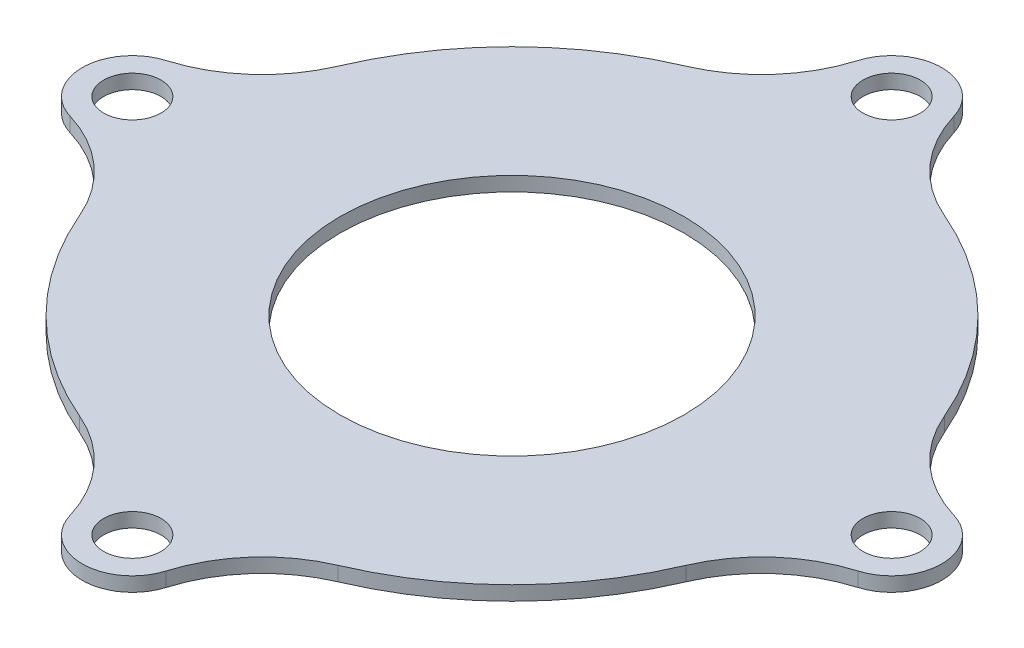
ISO-10303-21;
HEADER;
FILE_DESCRIPTION(('STEP AP214'),'2;1');
FILE_NAME('part.step','',(''),(''),'','','');
FILE_SCHEMA(('AUTOMOTIVE_DESIGN { 1 0 10303 214 1 1 1 1 }'));
ENDSEC;
DATA;
#1=APPLICATION_CONTEXT('core data for automotive mechanical design processes');
#2=APPLICATION_PROTOCOL_DEFINITION('international standard','automotive_design',2000,#1);
#3=PRODUCT_CONTEXT('',#1,'mechanical');
#4=PRODUCT('Part','Part','',(#3));
#5=PRODUCT_RELATED_PRODUCT_CATEGORY('part','',(#4));
#6=PRODUCT_DEFINITION_FORMATION('','',#4);
#7=PRODUCT_DEFINITION_CONTEXT('part definition',#1,'design');
#8=PRODUCT_DEFINITION('design','',#6,#7);
#9=PRODUCT_DEFINITION_SHAPE('','',#8);
#10=(LENGTH_UNIT() NAMED_UNIT(*) SI_UNIT(.MILLI.,.METRE.));
#11=(NAMED_UNIT(*) PLANE_ANGLE_UNIT() SI_UNIT($,.RADIAN.));
#12=(NAMED_UNIT(*) SI_UNIT($,.STERADIAN.) SOLID_ANGLE_UNIT());
#13=UNCERTAINTY_MEASURE_WITH_UNIT(LENGTH_MEASURE(1.E-05),#10,'distance_accuracy_value','');
#14=(GEOMETRIC_REPRESENTATION_CONTEXT(3) GLOBAL_UNCERTAINTY_ASSIGNED_CONTEXT((#13)) GLOBAL_UNIT_ASSIGNED_CONTEXT((#10,
#11,#12)) REPRESENTATION_CONTEXT('',''));
#15=CARTESIAN_POINT('',(0.,0.,0.));
#16=DIRECTION('',(0.,0.,1.));
#17=DIRECTION('',(1.,0.,0.));
#18=AXIS2_PLACEMENT_3D('',#15,#16,#17);
#19=CARTESIAN_POINT('',(0.,3.,0.));
#20=DIRECTION('',(0.,-1.,0.));
#21=DIRECTION('',(0.,0.,-1.));
#22=AXIS2_PLACEMENT_3D('',#19,#20,#21);
#23=CYLINDRICAL_SURFACE('',#22,23.);
#24=CARTESIAN_POINT('',(0.,1.,0.));
#25=DIRECTION('',(0.,1.,0.));
#26=DIRECTION('',(0.,0.,1.));
#27=AXIS2_PLACEMENT_3D('',#24,#25,#26);
#28=CIRCLE('',#27,23.);
#29=CARTESIAN_POINT('',(-21.1589479702687,1.,-9.01659141757354));
#30=VERTEX_POINT('',#29);
#31=CARTESIAN_POINT('',(-9.01659141757377,0.999999999999973,-21.1589479702686));
#32=VERTEX_POINT('',#31);
#33=EDGE_CURVE('E154',#30,#32,#28,.F.);
#34=ORIENTED_EDGE('',*,*,#33,.T.);
#35=DIRECTION('',(0.,-1.,0.));
#36=VECTOR('',#35,1.);
#37=CARTESIAN_POINT('',(-9.01659141757377,3.,-21.1589479702686));
#38=LINE('',#37,#36);
#39=CARTESIAN_POINT('',(-9.01659141757377,0.,-21.1589479702686));
#40=VERTEX_POINT('',#39);
#41=EDGE_CURVE('E167',#32,#40,#38,.T.);
#42=ORIENTED_EDGE('',*,*,#41,.T.);
#43=CARTESIAN_POINT('',(0.,0.,0.));
#44=DIRECTION('',(0.,1.,0.));
#45=DIRECTION('',(0.,0.,1.));
#46=AXIS2_PLACEMENT_3D('',#43,#44,#45);
#47=CIRCLE('',#46,23.);
#48=CARTESIAN_POINT('',(-21.1589479702687,0.,-9.01659141757355));
#49=VERTEX_POINT('',#48);
#50=EDGE_CURVE('E267',#40,#49,#47,.T.);
#51=ORIENTED_EDGE('',*,*,#50,.T.);
#52=DIRECTION('',(0.,-1.,0.));
#53=VECTOR('',#52,1.);
#54=CARTESIAN_POINT('',(-21.1589479702687,3.,-9.01659141757355));
#55=LINE('',#54,#53);
#56=EDGE_CURVE('E170',#49,#30,#55,.F.);
#57=ORIENTED_EDGE('',*,*,#56,.T.);
#58=EDGE_LOOP('',(#34,#42,#51,#57));
#59=FACE_BOUND('',#58,.T.);
#60=ADVANCED_FACE('F39',(#59),#23,.T.);
#61=CARTESIAN_POINT('',(0.,1.,0.));
#62=DIRECTION('',(0.,1.,0.));
#63=DIRECTION('',(0.,0.,1.));
#64=AXIS2_PLACEMENT_3D('',#61,#62,#63);
#65=CIRCLE('',#64,23.);
#66=CARTESIAN_POINT('',(9.01659141757332,1.,-21.1589479702688));
#67=VERTEX_POINT('',#66);
#68=CARTESIAN_POINT('',(21.1589479702687,1.,-9.01659141757369));
#69=VERTEX_POINT('',#68);
#70=EDGE_CURVE('E249',#67,#69,#65,.F.);
#71=ORIENTED_EDGE('',*,*,#70,.T.);
#72=DIRECTION('',(0.,-1.,0.));
#73=VECTOR('',#72,1.);
#74=CARTESIAN_POINT('',(21.1589479702687,3.,-9.0165914175737));
#75=LINE('',#74,#73);
#76=CARTESIAN_POINT('',(21.1589479702687,0.,-9.01659141757369));
#77=VERTEX_POINT('',#76);
#78=EDGE_CURVE('E288',#69,#77,#75,.T.);
#79=ORIENTED_EDGE('',*,*,#78,.T.);
#80=CARTESIAN_POINT('',(9.01659141757333,0.,-21.1589479702688));
#81=VERTEX_POINT('',#80);
#82=EDGE_CURVE('E301',#77,#81,#47,.T.);
#83=ORIENTED_EDGE('',*,*,#82,.T.);
#84=DIRECTION('',(0.,-1.,0.));
#85=VECTOR('',#84,1.);
#86=CARTESIAN_POINT('',(9.01659141757333,3.,-21.1589479702688));
#87=LINE('',#86,#85);
#88=EDGE_CURVE('E285',#81,#67,#87,.F.);
#89=ORIENTED_EDGE('',*,*,#88,.T.);
#90=EDGE_LOOP('',(#71,#79,#83,#89));
#91=FACE_BOUND('',#90,.T.);
#92=ADVANCED_FACE('F322',(#91),#23,.T.);
#93=CARTESIAN_POINT('',(0.,1.,0.));
#94=DIRECTION('',(0.,1.,0.));
#95=DIRECTION('',(0.,0.,1.));
#96=AXIS2_PLACEMENT_3D('',#93,#94,#95);
#97=CIRCLE('',#96,23.);
#98=CARTESIAN_POINT('',(21.1589479702688,1.,9.0165914175734));
#99=VERTEX_POINT('',#98);
#100=CARTESIAN_POINT('',(9.01659141757363,1.,21.1589479702687));
#101=VERTEX_POINT('',#100);
#102=EDGE_CURVE('E237',#99,#101,#97,.F.);
#103=ORIENTED_EDGE('',*,*,#102,.T.);
#104=DIRECTION('',(0.,-1.,0.));
#105=VECTOR('',#104,1.);
#106=CARTESIAN_POINT('',(9.01659141757362,3.,21.1589479702687));
#107=LINE('',#106,#105);
#108=CARTESIAN_POINT('',(9.01659141757362,0.,21.1589479702687));
#109=VERTEX_POINT('',#108);
#110=EDGE_CURVE('E273',#101,#109,#107,.T.);
#111=ORIENTED_EDGE('',*,*,#110,.T.);
#112=CARTESIAN_POINT('',(21.1589479702688,0.,9.0165914175734));
#113=VERTEX_POINT('',#112);
#114=EDGE_CURVE('E270',#109,#113,#47,.T.);
#115=ORIENTED_EDGE('',*,*,#114,.T.);
#116=DIRECTION('',(0.,-1.,0.));
#117=VECTOR('',#116,1.);
#118=CARTESIAN_POINT('',(21.1589479702688,3.,9.0165914175734));
#119=LINE('',#118,#117);
#120=EDGE_CURVE('E269',#113,#99,#119,.F.);
#121=ORIENTED_EDGE('',*,*,#120,.T.);
#122=EDGE_LOOP('',(#103,#111,#115,#121));
#123=FACE_BOUND('',#122,.T.);
#124=ADVANCED_FACE('F307',(#123),#23,.T.);
#125=CARTESIAN_POINT('',(0.,1.,0.));
#126=DIRECTION('',(0.,1.,0.));
#127=DIRECTION('',(0.,0.,1.));
#128=AXIS2_PLACEMENT_3D('',#125,#126,#127);
#129=CIRCLE('',#128,23.);
#130=CARTESIAN_POINT('',(-9.01659141757347,1.,21.1589479702688));
#131=VERTEX_POINT('',#130);
#132=CARTESIAN_POINT('',(-21.1589479702687,1.,9.01659141757353));
#133=VERTEX_POINT('',#132);
#134=EDGE_CURVE('E54',#131,#133,#129,.F.);
#135=ORIENTED_EDGE('',*,*,#134,.T.);
#136=DIRECTION('',(0.,-1.,0.));
#137=VECTOR('',#136,1.);
#138=CARTESIAN_POINT('',(-21.1589479702687,3.,9.01659141757355));
#139=LINE('',#138,#137);
#140=CARTESIAN_POINT('',(-21.1589479702687,0.,9.01659141757355));
#141=VERTEX_POINT('',#140);
#142=EDGE_CURVE('E190',#133,#141,#139,.T.);
#143=ORIENTED_EDGE('',*,*,#142,.T.);
#144=CARTESIAN_POINT('',(-9.01659141757347,0.,21.1589479702688));
#145=VERTEX_POINT('',#144);
#146=EDGE_CURVE('E208',#141,#145,#47,.T.);
#147=ORIENTED_EDGE('',*,*,#146,.T.);
#148=DIRECTION('',(0.,-1.,0.));
#149=VECTOR('',#148,1.);
#150=CARTESIAN_POINT('',(-9.01659141757347,3.,21.1589479702688));
#151=LINE('',#150,#149);
#152=EDGE_CURVE('E187',#145,#131,#151,.F.);
#153=ORIENTED_EDGE('',*,*,#152,.T.);
#154=EDGE_LOOP('',(#135,#143,#147,#153));
#155=FACE_BOUND('',#154,.T.);
#156=ADVANCED_FACE('F329',(#155),#23,.T.);
#157=CARTESIAN_POINT('',(0.,10.,0.));
#158=DIRECTION('',(0.,-1.,0.));
#159=DIRECTION('',(0.,0.,-1.));
#160=AXIS2_PLACEMENT_3D('',#157,#158,#159);
#161=CYLINDRICAL_SURFACE('',#160,12.);
#162=CARTESIAN_POINT('',(0.,0.,0.));
#163=DIRECTION('',(0.,-1.,0.));
#164=DIRECTION('',(0.,0.,-1.));
#165=AXIS2_PLACEMENT_3D('',#162,#163,#164);
#166=CIRCLE('',#165,12.);
#167=CARTESIAN_POINT('',(0.,0.,-12.));
#168=VERTEX_POINT('',#167);
#169=EDGE_CURVE('E217',#168,#168,#166,.T.);
#170=ORIENTED_EDGE('',*,*,#169,.T.);
#171=EDGE_LOOP('',(#170));
#172=FACE_BOUND('',#171,.T.);
#173=CARTESIAN_POINT('',(0.,0.999999999999999,0.));
#174=DIRECTION('',(0.,1.,0.));
#175=DIRECTION('',(0.,0.,1.));
#176=AXIS2_PLACEMENT_3D('',#173,#174,#175);
#177=CIRCLE('',#176,12.);
#178=CARTESIAN_POINT('',(0.,0.999999999999999,12.));
#179=VERTEX_POINT('',#178);
#180=EDGE_CURVE('E162',#179,#179,#177,.F.);
#181=ORIENTED_EDGE('',*,*,#180,.F.);
#182=EDGE_LOOP('',(#181));
#183=FACE_BOUND('',#182,.T.);
#184=ADVANCED_FACE('F362',(#172,#183),#161,.F.);
#185=CARTESIAN_POINT('',(-26.5,3.,0.));
#186=DIRECTION('',(0.,-1.,0.));
#187=DIRECTION('',(0.,0.,-1.));
#188=AXIS2_PLACEMENT_3D('',#185,#186,#187);
#189=CYLINDRICAL_SURFACE('',#188,3.5);
#190=DIRECTION('',(0.,-1.,0.));
#191=VECTOR('',#190,1.);
#192=CARTESIAN_POINT('',(-27.5003494060098,3.,3.35399777368678));
#193=LINE('',#192,#191);
#194=CARTESIAN_POINT('',(-27.5003494060098,0.,3.35399777368678));
#195=VERTEX_POINT('',#194);
#196=CARTESIAN_POINT('',(-27.5003494060098,1.,3.35399777368677));
#197=VERTEX_POINT('',#196);
#198=EDGE_CURVE('E177',#195,#197,#193,.F.);
#199=ORIENTED_EDGE('',*,*,#198,.T.);
#200=CARTESIAN_POINT('',(-26.5,1.,0.));
#201=DIRECTION('',(0.,1.,0.));
#202=DIRECTION('',(0.,0.,1.));
#203=AXIS2_PLACEMENT_3D('',#200,#201,#202);
#204=CIRCLE('',#203,3.5);
#205=CARTESIAN_POINT('',(-27.5003494060098,1.,-3.35399777368678));
#206=VERTEX_POINT('',#205);
#207=EDGE_CURVE('E223',#197,#206,#204,.F.);
#208=ORIENTED_EDGE('',*,*,#207,.T.);
#209=DIRECTION('',(0.,-1.,0.));
#210=VECTOR('',#209,1.);
#211=CARTESIAN_POINT('',(-27.5003494060098,3.,-3.35399777368678));
#212=LINE('',#211,#210);
#213=CARTESIAN_POINT('',(-27.5003494060098,0.,-3.35399777368678));
#214=VERTEX_POINT('',#213);
#215=EDGE_CURVE('E180',#206,#214,#212,.T.);
#216=ORIENTED_EDGE('',*,*,#215,.T.);
#217=CARTESIAN_POINT('',(-26.5,0.,0.));
#218=DIRECTION('',(0.,-1.,0.));
#219=DIRECTION('',(0.,0.,-1.));
#220=AXIS2_PLACEMENT_3D('',#217,#218,#219);
#221=CIRCLE('',#220,3.5);
#222=EDGE_CURVE('E207',#195,#214,#221,.T.);
#223=ORIENTED_EDGE('',*,*,#222,.F.);
#224=EDGE_LOOP('',(#199,#208,#216,#223));
#225=FACE_BOUND('',#224,.T.);
#226=ADVANCED_FACE('F213',(#225),#189,.T.);
#227=CARTESIAN_POINT('',(0.,3.,26.5));
#228=DIRECTION('',(0.,-1.,0.));
#229=DIRECTION('',(0.,0.,-1.));
#230=AXIS2_PLACEMENT_3D('',#227,#228,#229);
#231=CYLINDRICAL_SURFACE('',#230,3.5);
#232=DIRECTION('',(0.,-1.,0.));
#233=VECTOR('',#232,1.);
#234=CARTESIAN_POINT('',(3.35399777368688,3.,27.5003494060098));
#235=LINE('',#234,#233);
#236=CARTESIAN_POINT('',(3.35399777368688,0.,27.5003494060098));
#237=VERTEX_POINT('',#236);
#238=CARTESIAN_POINT('',(3.35399777368688,1.,27.5003494060098));
#239=VERTEX_POINT('',#238);
#240=EDGE_CURVE('E277',#237,#239,#235,.F.);
#241=ORIENTED_EDGE('',*,*,#240,.T.);
#242=CARTESIAN_POINT('',(0.,1.,26.5));
#243=DIRECTION('',(0.,1.,0.));
#244=DIRECTION('',(0.,0.,1.));
#245=AXIS2_PLACEMENT_3D('',#242,#243,#244);
#246=CIRCLE('',#245,3.5);
#247=CARTESIAN_POINT('',(-3.35399777368668,1.,27.5003494060098));
#248=VERTEX_POINT('',#247);
#249=EDGE_CURVE('E231',#239,#248,#246,.F.);
#250=ORIENTED_EDGE('',*,*,#249,.T.);
#251=DIRECTION('',(0.,-1.,0.));
#252=VECTOR('',#251,1.);
#253=CARTESIAN_POINT('',(-3.35399777368668,3.,27.5003494060098));
#254=LINE('',#253,#252);
#255=CARTESIAN_POINT('',(-3.35399777368668,0.,27.5003494060098));
#256=VERTEX_POINT('',#255);
#257=EDGE_CURVE('E275',#248,#256,#254,.T.);
#258=ORIENTED_EDGE('',*,*,#257,.T.);
#259=CARTESIAN_POINT('',(0.,0.,26.5));
#260=DIRECTION('',(0.,-1.,0.));
#261=DIRECTION('',(0.,0.,-1.));
#262=AXIS2_PLACEMENT_3D('',#259,#260,#261);
#263=CIRCLE('',#262,3.5);
#264=EDGE_CURVE('E218',#237,#256,#263,.T.);
#265=ORIENTED_EDGE('',*,*,#264,.F.);
#266=EDGE_LOOP('',(#241,#250,#258,#265));
#267=FACE_BOUND('',#266,.T.);
#268=ADVANCED_FACE('F370',(#267),#231,.T.);
#269=CARTESIAN_POINT('',(26.5,3.,-1.85048510958686E-13));
#270=DIRECTION('',(0.,-1.,0.));
#271=DIRECTION('',(0.,0.,-1.));
#272=AXIS2_PLACEMENT_3D('',#269,#270,#271);
#273=CYLINDRICAL_SURFACE('',#272,3.5);
#274=DIRECTION('',(0.,-1.,0.));
#275=VECTOR('',#274,1.);
#276=CARTESIAN_POINT('',(27.5003494060098,3.,-3.35399777368697));
#277=LINE('',#276,#275);
#278=CARTESIAN_POINT('',(27.5003494060098,0.,-3.35399777368697));
#279=VERTEX_POINT('',#278);
#280=CARTESIAN_POINT('',(27.5003494060098,1.,-3.35399777368697));
#281=VERTEX_POINT('',#280);
#282=EDGE_CURVE('E280',#279,#281,#277,.F.);
#283=ORIENTED_EDGE('',*,*,#282,.T.);
#284=CARTESIAN_POINT('',(26.5,1.,-1.85048510958686E-13));
#285=DIRECTION('',(0.,1.,0.));
#286=DIRECTION('',(0.,0.,1.));
#287=AXIS2_PLACEMENT_3D('',#284,#285,#286);
#288=CIRCLE('',#287,3.5);
#289=CARTESIAN_POINT('',(27.5003494060098,1.,3.35399777368659));
#290=VERTEX_POINT('',#289);
#291=EDGE_CURVE('E243',#281,#290,#288,.F.);
#292=ORIENTED_EDGE('',*,*,#291,.T.);
#293=DIRECTION('',(0.,-1.,0.));
#294=VECTOR('',#293,1.);
#295=CARTESIAN_POINT('',(27.5003494060098,3.,3.35399777368659));
#296=LINE('',#295,#294);
#297=CARTESIAN_POINT('',(27.5003494060098,0.,3.35399777368659));
#298=VERTEX_POINT('',#297);
#299=EDGE_CURVE('E283',#290,#298,#296,.T.);
#300=ORIENTED_EDGE('',*,*,#299,.T.);
#301=CARTESIAN_POINT('',(26.5,0.,-1.85048510958686E-13));
#302=DIRECTION('',(0.,-1.,0.));
#303=DIRECTION('',(0.,0.,-1.));
#304=AXIS2_PLACEMENT_3D('',#301,#302,#303);
#305=CIRCLE('',#304,3.5);
#306=EDGE_CURVE('E261',#279,#298,#305,.T.);
#307=ORIENTED_EDGE('',*,*,#306,.F.);
#308=EDGE_LOOP('',(#283,#292,#300,#307));
#309=FACE_BOUND('',#308,.T.);
#310=ADVANCED_FACE('F315',(#309),#273,.T.);
#311=CARTESIAN_POINT('',(-2.77572766438029E-13,3.,-26.5));
#312=DIRECTION('',(0.,-1.,0.));
#313=DIRECTION('',(0.,0.,-1.));
#314=AXIS2_PLACEMENT_3D('',#311,#312,#313);
#315=CYLINDRICAL_SURFACE('',#314,3.5);
#316=DIRECTION('',(0.,-1.,0.));
#317=VECTOR('',#316,1.);
#318=CARTESIAN_POINT('',(-3.35399777368707,3.,-27.5003494060098));
#319=LINE('',#318,#317);
#320=CARTESIAN_POINT('',(-3.35399777368707,0.,-27.5003494060098));
#321=VERTEX_POINT('',#320);
#322=CARTESIAN_POINT('',(-3.35399777368706,1.,-27.5003494060098));
#323=VERTEX_POINT('',#322);
#324=EDGE_CURVE('E290',#321,#323,#319,.F.);
#325=ORIENTED_EDGE('',*,*,#324,.T.);
#326=CARTESIAN_POINT('',(-2.77572766438029E-13,1.,-26.5));
#327=DIRECTION('',(0.,1.,0.));
#328=DIRECTION('',(0.,0.,1.));
#329=AXIS2_PLACEMENT_3D('',#326,#327,#328);
#330=CIRCLE('',#329,3.5);
#331=CARTESIAN_POINT('',(3.35399777368649,1.,-27.5003494060098));
#332=VERTEX_POINT('',#331);
#333=EDGE_CURVE('E157',#323,#332,#330,.F.);
#334=ORIENTED_EDGE('',*,*,#333,.T.);
#335=DIRECTION('',(0.,-1.,0.));
#336=VECTOR('',#335,1.);
#337=CARTESIAN_POINT('',(3.35399777368649,3.,-27.5003494060098));
#338=LINE('',#337,#336);
#339=CARTESIAN_POINT('',(3.35399777368649,0.,-27.5003494060098));
#340=VERTEX_POINT('',#339);
#341=EDGE_CURVE('E182',#332,#340,#338,.T.);
#342=ORIENTED_EDGE('',*,*,#341,.T.);
#343=CARTESIAN_POINT('',(-2.77572766438029E-13,0.,-26.5));
#344=DIRECTION('',(0.,-1.,0.));
#345=DIRECTION('',(0.,0.,-1.));
#346=AXIS2_PLACEMENT_3D('',#343,#344,#345);
#347=CIRCLE('',#346,3.5);
#348=EDGE_CURVE('E258',#321,#340,#347,.T.);
#349=ORIENTED_EDGE('',*,*,#348,.F.);
#350=EDGE_LOOP('',(#325,#334,#342,#349));
#351=FACE_BOUND('',#350,.T.);
#352=ADVANCED_FACE('F295',(#351),#315,.T.);
#353=CARTESIAN_POINT('',(12.9368485556491,3.,30.3584905660377));
#354=DIRECTION('',(0.,1.,0.));
#355=DIRECTION('',(0.,0.,1.));
#356=AXIS2_PLACEMENT_3D('',#353,#354,#355);
#357=CYLINDRICAL_SURFACE('',#356,10.);
#358=CARTESIAN_POINT('',(12.9368485556491,1.,30.3584905660377));
#359=DIRECTION('',(0.,1.,0.));
#360=DIRECTION('',(0.,0.,1.));
#361=AXIS2_PLACEMENT_3D('',#358,#359,#360);
#362=CIRCLE('',#361,10.);
#363=EDGE_CURVE('E234',#101,#239,#362,.T.);
#364=ORIENTED_EDGE('',*,*,#363,.T.);
#365=ORIENTED_EDGE('',*,*,#240,.F.);
#366=CARTESIAN_POINT('',(12.9368485556491,0.,30.3584905660377));
#367=DIRECTION('',(0.,1.,0.));
#368=DIRECTION('',(0.,0.,1.));
#369=AXIS2_PLACEMENT_3D('',#366,#367,#368);
#370=CIRCLE('',#369,10.);
#371=EDGE_CURVE('E192',#109,#237,#370,.T.);
#372=ORIENTED_EDGE('',*,*,#371,.F.);
#373=ORIENTED_EDGE('',*,*,#110,.F.);
#374=EDGE_LOOP('',(#364,#365,#372,#373));
#375=FACE_BOUND('',#374,.T.);
#376=ADVANCED_FACE('F333',(#375),#357,.F.);
#377=CARTESIAN_POINT('',(30.3584905660378,3.,12.9368485556488));
#378=DIRECTION('',(0.,1.,0.));
#379=DIRECTION('',(0.,0.,1.));
#380=AXIS2_PLACEMENT_3D('',#377,#378,#379);
#381=CYLINDRICAL_SURFACE('',#380,10.);
#382=CARTESIAN_POINT('',(30.3584905660378,1.,12.9368485556488));
#383=DIRECTION('',(0.,1.,0.));
#384=DIRECTION('',(0.,0.,1.));
#385=AXIS2_PLACEMENT_3D('',#382,#383,#384);
#386=CIRCLE('',#385,10.);
#387=EDGE_CURVE('E240',#290,#99,#386,.T.);
#388=ORIENTED_EDGE('',*,*,#387,.T.);
#389=ORIENTED_EDGE('',*,*,#120,.F.);
#390=CARTESIAN_POINT('',(30.3584905660378,0.,12.9368485556488));
#391=DIRECTION('',(0.,1.,0.));
#392=DIRECTION('',(0.,0.,1.));
#393=AXIS2_PLACEMENT_3D('',#390,#391,#392);
#394=CIRCLE('',#393,10.);
#395=EDGE_CURVE('E194',#298,#113,#394,.T.);
#396=ORIENTED_EDGE('',*,*,#395,.F.);
#397=ORIENTED_EDGE('',*,*,#299,.F.);
#398=EDGE_LOOP('',(#388,#389,#396,#397));
#399=FACE_BOUND('',#398,.T.);
#400=ADVANCED_FACE('F312',(#399),#381,.F.);
#401=CARTESIAN_POINT('',(30.3584905660376,3.,-12.9368485556492));
#402=DIRECTION('',(0.,1.,0.));
#403=DIRECTION('',(0.,0.,1.));
#404=AXIS2_PLACEMENT_3D('',#401,#402,#403);
#405=CYLINDRICAL_SURFACE('',#404,10.);
#406=CARTESIAN_POINT('',(30.3584905660376,1.,-12.9368485556492));
#407=DIRECTION('',(0.,1.,0.));
#408=DIRECTION('',(0.,0.,1.));
#409=AXIS2_PLACEMENT_3D('',#406,#407,#408);
#410=CIRCLE('',#409,10.);
#411=EDGE_CURVE('E246',#69,#281,#410,.T.);
#412=ORIENTED_EDGE('',*,*,#411,.T.);
#413=ORIENTED_EDGE('',*,*,#282,.F.);
#414=CARTESIAN_POINT('',(30.3584905660376,0.,-12.9368485556492));
#415=DIRECTION('',(0.,1.,0.));
#416=DIRECTION('',(0.,0.,1.));
#417=AXIS2_PLACEMENT_3D('',#414,#415,#416);
#418=CIRCLE('',#417,10.);
#419=EDGE_CURVE('E196',#77,#279,#418,.T.);
#420=ORIENTED_EDGE('',*,*,#419,.F.);
#421=ORIENTED_EDGE('',*,*,#78,.F.);
#422=EDGE_LOOP('',(#412,#413,#420,#421));
#423=FACE_BOUND('',#422,.T.);
#424=ADVANCED_FACE('F320',(#423),#405,.F.);
#425=CARTESIAN_POINT('',(12.9368485556487,3.,-30.3584905660379));
#426=DIRECTION('',(0.,1.,0.));
#427=DIRECTION('',(0.,0.,1.));
#428=AXIS2_PLACEMENT_3D('',#425,#426,#427);
#429=CYLINDRICAL_SURFACE('',#428,10.);
#430=CARTESIAN_POINT('',(12.9368485556487,1.,-30.3584905660379));
#431=DIRECTION('',(0.,1.,0.));
#432=DIRECTION('',(0.,0.,1.));
#433=AXIS2_PLACEMENT_3D('',#430,#431,#432);
#434=CIRCLE('',#433,10.);
#435=EDGE_CURVE('E252',#332,#67,#434,.T.);
#436=ORIENTED_EDGE('',*,*,#435,.T.);
#437=ORIENTED_EDGE('',*,*,#88,.F.);
#438=CARTESIAN_POINT('',(12.9368485556487,0.,-30.3584905660379));
#439=DIRECTION('',(0.,1.,0.));
#440=DIRECTION('',(0.,0.,1.));
#441=AXIS2_PLACEMENT_3D('',#438,#439,#440);
#442=CIRCLE('',#441,10.);
#443=EDGE_CURVE('E198',#340,#81,#442,.T.);
#444=ORIENTED_EDGE('',*,*,#443,.F.);
#445=ORIENTED_EDGE('',*,*,#341,.F.);
#446=EDGE_LOOP('',(#436,#437,#444,#445));
#447=FACE_BOUND('',#446,.T.);
#448=ADVANCED_FACE('F298',(#447),#429,.F.);
#449=CARTESIAN_POINT('',(-12.9368485556493,3.,-30.3584905660376));
#450=DIRECTION('',(0.,1.,0.));
#451=DIRECTION('',(0.,0.,1.));
#452=AXIS2_PLACEMENT_3D('',#449,#450,#451);
#453=CYLINDRICAL_SURFACE('',#452,10.);
#454=CARTESIAN_POINT('',(-12.9368485556493,1.,-30.3584905660376));
#455=DIRECTION('',(0.,1.,0.));
#456=DIRECTION('',(0.,0.,1.));
#457=AXIS2_PLACEMENT_3D('',#454,#455,#456);
#458=CIRCLE('',#457,10.);
#459=EDGE_CURVE('E150',#32,#323,#458,.T.);
#460=ORIENTED_EDGE('',*,*,#459,.T.);
#461=ORIENTED_EDGE('',*,*,#324,.F.);
#462=CARTESIAN_POINT('',(-12.9368485556493,0.,-30.3584905660376));
#463=DIRECTION('',(0.,1.,0.));
#464=DIRECTION('',(0.,0.,1.));
#465=AXIS2_PLACEMENT_3D('',#462,#463,#464);
#466=CIRCLE('',#465,10.);
#467=EDGE_CURVE('E175',#40,#321,#466,.T.);
#468=ORIENTED_EDGE('',*,*,#467,.F.);
#469=ORIENTED_EDGE('',*,*,#41,.F.);
#470=EDGE_LOOP('',(#460,#461,#468,#469));
#471=FACE_BOUND('',#470,.T.);
#472=ADVANCED_FACE('F174',(#471),#453,.F.);
#473=CARTESIAN_POINT('',(-30.3584905660377,3.,-12.936848555649));
#474=DIRECTION('',(0.,1.,0.));
#475=DIRECTION('',(0.,0.,1.));
#476=AXIS2_PLACEMENT_3D('',#473,#474,#475);
#477=CYLINDRICAL_SURFACE('',#476,10.);
#478=CARTESIAN_POINT('',(-30.3584905660377,1.,-12.936848555649));
#479=DIRECTION('',(0.,1.,0.));
#480=DIRECTION('',(0.,0.,1.));
#481=AXIS2_PLACEMENT_3D('',#478,#479,#480);
#482=CIRCLE('',#481,10.);
#483=EDGE_CURVE('E171',#206,#30,#482,.T.);
#484=ORIENTED_EDGE('',*,*,#483,.T.);
#485=ORIENTED_EDGE('',*,*,#56,.F.);
#486=CARTESIAN_POINT('',(-30.3584905660377,0.,-12.936848555649));
#487=DIRECTION('',(0.,1.,0.));
#488=DIRECTION('',(0.,0.,1.));
#489=AXIS2_PLACEMENT_3D('',#486,#487,#488);
#490=CIRCLE('',#489,10.);
#491=EDGE_CURVE('E201',#214,#49,#490,.T.);
#492=ORIENTED_EDGE('',*,*,#491,.F.);
#493=ORIENTED_EDGE('',*,*,#215,.F.);
#494=EDGE_LOOP('',(#484,#485,#492,#493));
#495=FACE_BOUND('',#494,.T.);
#496=ADVANCED_FACE('F345',(#495),#477,.F.);
#497=CARTESIAN_POINT('',(-30.3584905660377,3.,12.936848555649));
#498=DIRECTION('',(0.,1.,0.));
#499=DIRECTION('',(0.,0.,1.));
#500=AXIS2_PLACEMENT_3D('',#497,#498,#499);
#501=CYLINDRICAL_SURFACE('',#500,10.);
#502=CARTESIAN_POINT('',(-30.3584905660377,1.,12.936848555649));
#503=DIRECTION('',(0.,1.,0.));
#504=DIRECTION('',(0.,0.,1.));
#505=AXIS2_PLACEMENT_3D('',#502,#503,#504);
#506=CIRCLE('',#505,10.);
#507=EDGE_CURVE('E222',#133,#197,#506,.T.);
#508=ORIENTED_EDGE('',*,*,#507,.T.);
#509=ORIENTED_EDGE('',*,*,#198,.F.);
#510=CARTESIAN_POINT('',(-30.3584905660377,0.,12.936848555649));
#511=DIRECTION('',(0.,1.,0.));
#512=DIRECTION('',(0.,0.,1.));
#513=AXIS2_PLACEMENT_3D('',#510,#511,#512);
#514=CIRCLE('',#513,10.);
#515=EDGE_CURVE('E47',#141,#195,#514,.T.);
#516=ORIENTED_EDGE('',*,*,#515,.F.);
#517=ORIENTED_EDGE('',*,*,#142,.F.);
#518=EDGE_LOOP('',(#508,#509,#516,#517));
#519=FACE_BOUND('',#518,.T.);
#520=ADVANCED_FACE('F221',(#519),#501,.F.);
#521=CARTESIAN_POINT('',(-12.9368485556489,3.,30.3584905660378));
#522=DIRECTION('',(0.,1.,0.));
#523=DIRECTION('',(0.,0.,1.));
#524=AXIS2_PLACEMENT_3D('',#521,#522,#523);
#525=CYLINDRICAL_SURFACE('',#524,10.);
#526=CARTESIAN_POINT('',(-12.9368485556489,1.,30.3584905660378));
#527=DIRECTION('',(0.,1.,0.));
#528=DIRECTION('',(0.,0.,1.));
#529=AXIS2_PLACEMENT_3D('',#526,#527,#528);
#530=CIRCLE('',#529,10.);
#531=EDGE_CURVE('E225',#248,#131,#530,.T.);
#532=ORIENTED_EDGE('',*,*,#531,.T.);
#533=ORIENTED_EDGE('',*,*,#152,.F.);
#534=CARTESIAN_POINT('',(-12.9368485556489,0.,30.3584905660378));
#535=DIRECTION('',(0.,1.,0.));
#536=DIRECTION('',(0.,0.,1.));
#537=AXIS2_PLACEMENT_3D('',#534,#535,#536);
#538=CIRCLE('',#537,10.);
#539=EDGE_CURVE('E12',#256,#145,#538,.T.);
#540=ORIENTED_EDGE('',*,*,#539,.F.);
#541=ORIENTED_EDGE('',*,*,#257,.F.);
#542=EDGE_LOOP('',(#532,#533,#540,#541));
#543=FACE_BOUND('',#542,.T.);
#544=ADVANCED_FACE('F41',(#543),#525,.F.);
#545=CARTESIAN_POINT('',(0.,0.,0.));
#546=DIRECTION('',(0.,1.,0.));
#547=DIRECTION('',(0.,0.,1.));
#548=AXIS2_PLACEMENT_3D('',#545,#546,#547);
#549=PLANE('',#548);
#550=ORIENTED_EDGE('',*,*,#169,.F.);
#551=EDGE_LOOP('',(#550));
#552=FACE_BOUND('',#551,.T.);
#553=ORIENTED_EDGE('',*,*,#146,.F.);
#554=ORIENTED_EDGE('',*,*,#515,.T.);
#555=ORIENTED_EDGE('',*,*,#222,.T.);
#556=ORIENTED_EDGE('',*,*,#491,.T.);
#557=ORIENTED_EDGE('',*,*,#50,.F.);
#558=ORIENTED_EDGE('',*,*,#467,.T.);
#559=ORIENTED_EDGE('',*,*,#348,.T.);
#560=ORIENTED_EDGE('',*,*,#443,.T.);
#561=ORIENTED_EDGE('',*,*,#82,.F.);
#562=ORIENTED_EDGE('',*,*,#419,.T.);
#563=ORIENTED_EDGE('',*,*,#306,.T.);
#564=ORIENTED_EDGE('',*,*,#395,.T.);
#565=ORIENTED_EDGE('',*,*,#114,.F.);
#566=ORIENTED_EDGE('',*,*,#371,.T.);
#567=ORIENTED_EDGE('',*,*,#264,.T.);
#568=ORIENTED_EDGE('',*,*,#539,.T.);
#569=EDGE_LOOP('',(#553,#554,#555,#556,#557,#558,#559,#560,#561,#562,#563,#564,#565,#566,#567,#568));
#570=FACE_BOUND('',#569,.T.);
#571=CARTESIAN_POINT('',(4.62621277396715E-13,0.,26.5));
#572=DIRECTION('',(0.,-1.,0.));
#573=DIRECTION('',(0.,0.,-1.));
#574=AXIS2_PLACEMENT_3D('',#571,#572,#573);
#575=CIRCLE('',#574,2.);
#576=CARTESIAN_POINT('',(4.62621277396715E-13,0.,24.5));
#577=VERTEX_POINT('',#576);
#578=EDGE_CURVE('E421',#577,#577,#575,.T.);
#579=ORIENTED_EDGE('',*,*,#578,.F.);
#580=EDGE_LOOP('',(#579));
#581=FACE_BOUND('',#580,.T.);
#582=CARTESIAN_POINT('',(26.5,0.,-5.55145532876058E-13));
#583=DIRECTION('',(0.,-1.,0.));
#584=DIRECTION('',(0.,0.,-1.));
#585=AXIS2_PLACEMENT_3D('',#582,#583,#584);
#586=CIRCLE('',#585,2.);
#587=CARTESIAN_POINT('',(26.5,0.,-2.00000000000056));
#588=VERTEX_POINT('',#587);
#589=EDGE_CURVE('E418',#588,#588,#586,.T.);
#590=ORIENTED_EDGE('',*,*,#589,.F.);
#591=EDGE_LOOP('',(#590));
#592=FACE_BOUND('',#591,.T.);
#593=CARTESIAN_POINT('',(-6.47669788355401E-13,0.,-26.5));
#594=DIRECTION('',(0.,-1.,0.));
#595=DIRECTION('',(0.,0.,-1.));
#596=AXIS2_PLACEMENT_3D('',#593,#594,#595);
#597=CIRCLE('',#596,2.);
#598=CARTESIAN_POINT('',(-6.47669788355401E-13,0.,-28.5));
#599=VERTEX_POINT('',#598);
#600=EDGE_CURVE('E411',#599,#599,#597,.T.);
#601=ORIENTED_EDGE('',*,*,#600,.F.);
#602=EDGE_LOOP('',(#601));
#603=FACE_BOUND('',#602,.T.);
#604=CARTESIAN_POINT('',(-26.5,0.,7.40194043834744E-13));
#605=DIRECTION('',(0.,-1.,0.));
#606=DIRECTION('',(0.,0.,-1.));
#607=AXIS2_PLACEMENT_3D('',#604,#605,#606);
#608=CIRCLE('',#607,2.);
#609=CARTESIAN_POINT('',(-26.5,0.,-1.99999999999926));
#610=VERTEX_POINT('',#609);
#611=EDGE_CURVE('E406',#610,#610,#608,.T.);
#612=ORIENTED_EDGE('',*,*,#611,.F.);
#613=EDGE_LOOP('',(#612));
#614=FACE_BOUND('',#613,.T.);
#615=ADVANCED_FACE('F205',(#552,#570,#581,#592,#603,#614),#549,.F.);
#616=CARTESIAN_POINT('',(0.,1.,0.));
#617=DIRECTION('',(0.,1.,0.));
#618=DIRECTION('',(0.,0.,1.));
#619=AXIS2_PLACEMENT_3D('',#616,#617,#618);
#620=PLANE('',#619);
#621=ORIENTED_EDGE('',*,*,#333,.F.);
#622=ORIENTED_EDGE('',*,*,#459,.F.);
#623=ORIENTED_EDGE('',*,*,#33,.F.);
#624=ORIENTED_EDGE('',*,*,#483,.F.);
#625=ORIENTED_EDGE('',*,*,#207,.F.);
#626=ORIENTED_EDGE('',*,*,#507,.F.);
#627=ORIENTED_EDGE('',*,*,#134,.F.);
#628=ORIENTED_EDGE('',*,*,#531,.F.);
#629=ORIENTED_EDGE('',*,*,#249,.F.);
#630=ORIENTED_EDGE('',*,*,#363,.F.);
#631=ORIENTED_EDGE('',*,*,#102,.F.);
#632=ORIENTED_EDGE('',*,*,#387,.F.);
#633=ORIENTED_EDGE('',*,*,#291,.F.);
#634=ORIENTED_EDGE('',*,*,#411,.F.);
#635=ORIENTED_EDGE('',*,*,#70,.F.);
#636=ORIENTED_EDGE('',*,*,#435,.F.);
#637=EDGE_LOOP('',(#621,#622,#623,#624,#625,#626,#627,#628,#629,#630,#631,#632,#633,#634,#635,#636));
#638=FACE_BOUND('',#637,.T.);
#639=ORIENTED_EDGE('',*,*,#180,.T.);
#640=EDGE_LOOP('',(#639));
#641=FACE_BOUND('',#640,.T.);
#642=CARTESIAN_POINT('',(4.62621277396715E-13,1.,26.5));
#643=DIRECTION('',(0.,-1.,0.));
#644=DIRECTION('',(0.,0.,-1.));
#645=AXIS2_PLACEMENT_3D('',#642,#643,#644);
#646=CIRCLE('',#645,2.);
#647=CARTESIAN_POINT('',(4.62621277396715E-13,1.,24.5));
#648=VERTEX_POINT('',#647);
#649=EDGE_CURVE('E172',#648,#648,#646,.T.);
#650=ORIENTED_EDGE('',*,*,#649,.T.);
#651=EDGE_LOOP('',(#650));
#652=FACE_BOUND('',#651,.T.);
#653=CARTESIAN_POINT('',(26.5,1.,-5.55145532876058E-13));
#654=DIRECTION('',(0.,-1.,0.));
#655=DIRECTION('',(0.,0.,-1.));
#656=AXIS2_PLACEMENT_3D('',#653,#654,#655);
#657=CIRCLE('',#656,2.);
#658=CARTESIAN_POINT('',(26.5,1.,-2.00000000000056));
#659=VERTEX_POINT('',#658);
#660=EDGE_CURVE('E416',#659,#659,#657,.T.);
#661=ORIENTED_EDGE('',*,*,#660,.T.);
#662=EDGE_LOOP('',(#661));
#663=FACE_BOUND('',#662,.T.);
#664=CARTESIAN_POINT('',(-6.47669788355401E-13,1.,-26.5));
#665=DIRECTION('',(0.,-1.,0.));
#666=DIRECTION('',(0.,0.,-1.));
#667=AXIS2_PLACEMENT_3D('',#664,#665,#666);
#668=CIRCLE('',#667,2.);
#669=CARTESIAN_POINT('',(-6.47669788355401E-13,1.,-28.5));
#670=VERTEX_POINT('',#669);
#671=EDGE_CURVE('E408',#670,#670,#668,.T.);
#672=ORIENTED_EDGE('',*,*,#671,.T.);
#673=EDGE_LOOP('',(#672));
#674=FACE_BOUND('',#673,.T.);
#675=CARTESIAN_POINT('',(-26.5,1.,7.40194043834744E-13));
#676=DIRECTION('',(0.,-1.,0.));
#677=DIRECTION('',(0.,0.,-1.));
#678=AXIS2_PLACEMENT_3D('',#675,#676,#677);
#679=CIRCLE('',#678,2.);
#680=CARTESIAN_POINT('',(-26.5,1.,-1.99999999999926));
#681=VERTEX_POINT('',#680);
#682=EDGE_CURVE('E403',#681,#681,#679,.T.);
#683=ORIENTED_EDGE('',*,*,#682,.T.);
#684=EDGE_LOOP('',(#683));
#685=FACE_BOUND('',#684,.T.);
#686=ADVANCED_FACE('F152',(#638,#641,#652,#663,#674,#685),#620,.T.);
#687=CARTESIAN_POINT('',(4.62621277396715E-13,1.,26.5));
#688=DIRECTION('',(0.,-1.,0.));
#689=DIRECTION('',(0.,0.,-1.));
#690=AXIS2_PLACEMENT_3D('',#687,#688,#689);
#691=CYLINDRICAL_SURFACE('',#690,2.);
#692=ORIENTED_EDGE('',*,*,#649,.F.);
#693=EDGE_LOOP('',(#692));
#694=FACE_BOUND('',#693,.T.);
#695=ORIENTED_EDGE('',*,*,#578,.T.);
#696=EDGE_LOOP('',(#695));
#697=FACE_BOUND('',#696,.T.);
#698=ADVANCED_FACE('F383',(#694,#697),#691,.F.);
#699=CARTESIAN_POINT('',(26.5,1.,-5.55145532876058E-13));
#700=DIRECTION('',(0.,-1.,0.));
#701=DIRECTION('',(0.,0.,-1.));
#702=AXIS2_PLACEMENT_3D('',#699,#700,#701);
#703=CYLINDRICAL_SURFACE('',#702,2.);
#704=ORIENTED_EDGE('',*,*,#660,.F.);
#705=EDGE_LOOP('',(#704));
#706=FACE_BOUND('',#705,.T.);
#707=ORIENTED_EDGE('',*,*,#589,.T.);
#708=EDGE_LOOP('',(#707));
#709=FACE_BOUND('',#708,.T.);
#710=ADVANCED_FACE('F386',(#706,#709),#703,.F.);
#711=CARTESIAN_POINT('',(-6.47669788355401E-13,1.,-26.5));
#712=DIRECTION('',(0.,-1.,0.));
#713=DIRECTION('',(0.,0.,-1.));
#714=AXIS2_PLACEMENT_3D('',#711,#712,#713);
#715=CYLINDRICAL_SURFACE('',#714,2.);
#716=ORIENTED_EDGE('',*,*,#671,.F.);
#717=EDGE_LOOP('',(#716));
#718=FACE_BOUND('',#717,.T.);
#719=ORIENTED_EDGE('',*,*,#600,.T.);
#720=EDGE_LOOP('',(#719));
#721=FACE_BOUND('',#720,.T.);
#722=ADVANCED_FACE('F390',(#718,#721),#715,.F.);
#723=CARTESIAN_POINT('',(-26.5,1.,7.40194043834744E-13));
#724=DIRECTION('',(0.,-1.,0.));
#725=DIRECTION('',(0.,0.,-1.));
#726=AXIS2_PLACEMENT_3D('',#723,#724,#725);
#727=CYLINDRICAL_SURFACE('',#726,2.);
#728=ORIENTED_EDGE('',*,*,#682,.F.);
#729=EDGE_LOOP('',(#728));
#730=FACE_BOUND('',#729,.T.);
#731=ORIENTED_EDGE('',*,*,#611,.T.);
#732=EDGE_LOOP('',(#731));
#733=FACE_BOUND('',#732,.T.);
#734=ADVANCED_FACE('F394',(#730,#733),#727,.F.);
#735=CLOSED_SHELL('',(#60,#92,#124,#156,#184,#226,#268,#310,#352,#376,#400,#424,#448,#472,#496,
#520,#544,#615,#686,#698,#710,#722,#734));
#736=MANIFOLD_SOLID_BREP('B2',#735);
#737=ADVANCED_BREP_SHAPE_REPRESENTATION('',(#18,#736),#14);
#738=SHAPE_DEFINITION_REPRESENTATION(#9,#737);
ENDSEC;
END-ISO-10303-21;
